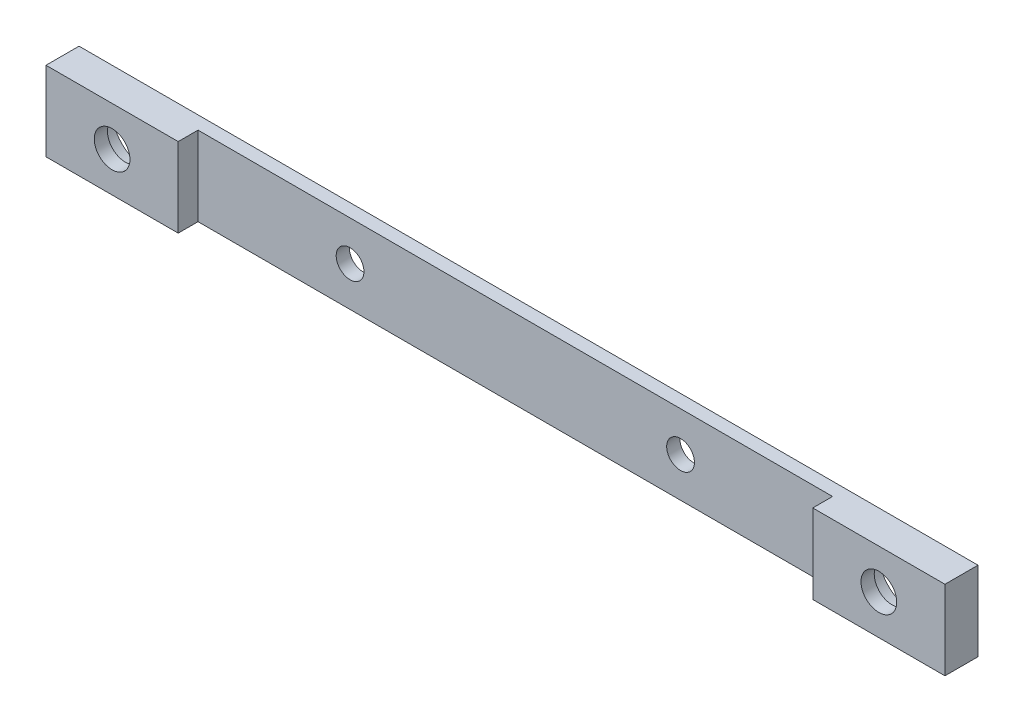
ISO-10303-21;
HEADER;
FILE_DESCRIPTION(('STEP AP214'),'2;1');
FILE_NAME('part.step','',(''),(''),'','','');
FILE_SCHEMA(('AUTOMOTIVE_DESIGN { 1 0 10303 214 1 1 1 1 }'));
ENDSEC;
DATA;
#1=APPLICATION_CONTEXT('core data for automotive mechanical design processes');
#2=APPLICATION_PROTOCOL_DEFINITION('international standard','automotive_design',2000,#1);
#3=PRODUCT_CONTEXT('',#1,'mechanical');
#4=PRODUCT('Part','Part','',(#3));
#5=PRODUCT_RELATED_PRODUCT_CATEGORY('part','',(#4));
#6=PRODUCT_DEFINITION_FORMATION('','',#4);
#7=PRODUCT_DEFINITION_CONTEXT('part definition',#1,'design');
#8=PRODUCT_DEFINITION('design','',#6,#7);
#9=PRODUCT_DEFINITION_SHAPE('','',#8);
#10=(LENGTH_UNIT() NAMED_UNIT(*) SI_UNIT(.MILLI.,.METRE.));
#11=(NAMED_UNIT(*) PLANE_ANGLE_UNIT() SI_UNIT($,.RADIAN.));
#12=(NAMED_UNIT(*) SI_UNIT($,.STERADIAN.) SOLID_ANGLE_UNIT());
#13=UNCERTAINTY_MEASURE_WITH_UNIT(LENGTH_MEASURE(1.E-05),#10,'distance_accuracy_value','');
#14=(GEOMETRIC_REPRESENTATION_CONTEXT(3) GLOBAL_UNCERTAINTY_ASSIGNED_CONTEXT((#13)) GLOBAL_UNIT_ASSIGNED_CONTEXT((#10,
#11,#12)) REPRESENTATION_CONTEXT('',''));
#15=CARTESIAN_POINT('',(0.,0.,0.));
#16=DIRECTION('',(0.,0.,1.));
#17=DIRECTION('',(1.,0.,0.));
#18=AXIS2_PLACEMENT_3D('',#15,#16,#17);
#19=CARTESIAN_POINT('',(58.,0.,5.));
#20=DIRECTION('',(0.,0.,-1.));
#21=DIRECTION('',(-1.,0.,0.));
#22=AXIS2_PLACEMENT_3D('',#19,#20,#21);
#23=CYLINDRICAL_SURFACE('',#22,2.7);
#24=CARTESIAN_POINT('',(58.,0.,5.));
#25=DIRECTION('',(0.,0.,1.));
#26=DIRECTION('',(1.,0.,0.));
#27=AXIS2_PLACEMENT_3D('',#24,#25,#26);
#28=CIRCLE('',#27,2.7);
#29=CARTESIAN_POINT('',(60.7,0.,5.));
#30=VERTEX_POINT('',#29);
#31=EDGE_CURVE('E169',#30,#30,#28,.F.);
#32=ORIENTED_EDGE('',*,*,#31,.F.);
#33=EDGE_LOOP('',(#32));
#34=FACE_BOUND('',#33,.T.);
#35=CARTESIAN_POINT('',(58.,0.,3.));
#36=DIRECTION('',(0.,0.,-1.));
#37=DIRECTION('',(-1.,0.,0.));
#38=AXIS2_PLACEMENT_3D('',#35,#36,#37);
#39=CIRCLE('',#38,2.7);
#40=CARTESIAN_POINT('',(55.3,0.,3.));
#41=VERTEX_POINT('',#40);
#42=EDGE_CURVE('E40',#41,#41,#39,.F.);
#43=ORIENTED_EDGE('',*,*,#42,.F.);
#44=EDGE_LOOP('',(#43));
#45=FACE_BOUND('',#44,.T.);
#46=ADVANCED_FACE('F36',(#34,#45),#23,.F.);
#47=CARTESIAN_POINT('',(0.,0.,0.));
#48=DIRECTION('',(0.,0.,1.));
#49=DIRECTION('',(1.,0.,0.));
#50=AXIS2_PLACEMENT_3D('',#47,#48,#49);
#51=PLANE('',#50);
#52=CARTESIAN_POINT('',(58.,0.,0.));
#53=DIRECTION('',(0.,0.,-1.));
#54=DIRECTION('',(-1.,0.,0.));
#55=AXIS2_PLACEMENT_3D('',#52,#53,#54);
#56=CIRCLE('',#55,5.);
#57=CARTESIAN_POINT('',(53.,0.,0.));
#58=VERTEX_POINT('',#57);
#59=EDGE_CURVE('E448',#58,#58,#56,.T.);
#60=ORIENTED_EDGE('',*,*,#59,.F.);
#61=EDGE_LOOP('',(#60));
#62=FACE_BOUND('',#61,.T.);
#63=DIRECTION('',(1.,0.,0.));
#64=VECTOR('',#63,1.);
#65=CARTESIAN_POINT('',(0.,6.,0.));
#66=LINE('',#65,#64);
#67=CARTESIAN_POINT('',(-68.,6.,0.));
#68=VERTEX_POINT('',#67);
#69=CARTESIAN_POINT('',(68.,6.,0.));
#70=VERTEX_POINT('',#69);
#71=EDGE_CURVE('E183',#68,#70,#66,.T.);
#72=ORIENTED_EDGE('',*,*,#71,.T.);
#73=DIRECTION('',(0.,1.,0.));
#74=VECTOR('',#73,1.);
#75=CARTESIAN_POINT('',(68.,0.,0.));
#76=LINE('',#75,#74);
#77=CARTESIAN_POINT('',(68.,-6.,0.));
#78=VERTEX_POINT('',#77);
#79=EDGE_CURVE('E195',#78,#70,#76,.T.);
#80=ORIENTED_EDGE('',*,*,#79,.F.);
#81=DIRECTION('',(1.,0.,0.));
#82=VECTOR('',#81,1.);
#83=CARTESIAN_POINT('',(0.,-6.,0.));
#84=LINE('',#83,#82);
#85=CARTESIAN_POINT('',(-68.,-6.,0.));
#86=VERTEX_POINT('',#85);
#87=EDGE_CURVE('E191',#86,#78,#84,.T.);
#88=ORIENTED_EDGE('',*,*,#87,.F.);
#89=DIRECTION('',(0.,1.,0.));
#90=VECTOR('',#89,1.);
#91=CARTESIAN_POINT('',(-68.,0.,0.));
#92=LINE('',#91,#90);
#93=EDGE_CURVE('E187',#86,#68,#92,.T.);
#94=ORIENTED_EDGE('',*,*,#93,.T.);
#95=EDGE_LOOP('',(#72,#80,#88,#94));
#96=FACE_BOUND('',#95,.T.);
#97=CARTESIAN_POINT('',(-25.,0.,0.));
#98=DIRECTION('',(0.,0.,1.));
#99=DIRECTION('',(1.,0.,0.));
#100=AXIS2_PLACEMENT_3D('',#97,#98,#99);
#101=CIRCLE('',#100,2.1);
#102=CARTESIAN_POINT('',(-22.9,0.,0.));
#103=VERTEX_POINT('',#102);
#104=EDGE_CURVE('E179',#103,#103,#101,.T.);
#105=ORIENTED_EDGE('',*,*,#104,.T.);
#106=EDGE_LOOP('',(#105));
#107=FACE_BOUND('',#106,.T.);
#108=CARTESIAN_POINT('',(25.,0.,0.));
#109=DIRECTION('',(0.,0.,1.));
#110=DIRECTION('',(1.,0.,0.));
#111=AXIS2_PLACEMENT_3D('',#108,#109,#110);
#112=CIRCLE('',#111,2.1);
#113=CARTESIAN_POINT('',(27.1,0.,0.));
#114=VERTEX_POINT('',#113);
#115=EDGE_CURVE('E153',#114,#114,#112,.F.);
#116=ORIENTED_EDGE('',*,*,#115,.F.);
#117=EDGE_LOOP('',(#116));
#118=FACE_BOUND('',#117,.T.);
#119=CARTESIAN_POINT('',(-58.,0.,0.));
#120=DIRECTION('',(0.,0.,1.));
#121=DIRECTION('',(1.,0.,0.));
#122=AXIS2_PLACEMENT_3D('',#119,#120,#121);
#123=CIRCLE('',#122,5.);
#124=CARTESIAN_POINT('',(-53.,0.,0.));
#125=VERTEX_POINT('',#124);
#126=EDGE_CURVE('E217',#125,#125,#123,.T.);
#127=ORIENTED_EDGE('',*,*,#126,.T.);
#128=EDGE_LOOP('',(#127));
#129=FACE_BOUND('',#128,.T.);
#130=ADVANCED_FACE('F249',(#62,#96,#107,#118,#129),#51,.F.);
#131=CARTESIAN_POINT('',(0.,0.,5.));
#132=DIRECTION('',(0.,0.,1.));
#133=DIRECTION('',(1.,0.,0.));
#134=AXIS2_PLACEMENT_3D('',#131,#132,#133);
#135=PLANE('',#134);
#136=DIRECTION('',(0.,-1.,0.));
#137=VECTOR('',#136,1.);
#138=CARTESIAN_POINT('',(48.,102.046863561493,5.));
#139=LINE('',#138,#137);
#140=CARTESIAN_POINT('',(48.,6.00000000000001,5.));
#141=VERTEX_POINT('',#140);
#142=CARTESIAN_POINT('',(48.,-6.,5.));
#143=VERTEX_POINT('',#142);
#144=EDGE_CURVE('E115',#141,#143,#139,.T.);
#145=ORIENTED_EDGE('',*,*,#144,.T.);
#146=DIRECTION('',(1.,0.,0.));
#147=VECTOR('',#146,1.);
#148=CARTESIAN_POINT('',(0.,-6.,5.));
#149=LINE('',#148,#147);
#150=CARTESIAN_POINT('',(68.,-6.,5.));
#151=VERTEX_POINT('',#150);
#152=EDGE_CURVE('E161',#143,#151,#149,.T.);
#153=ORIENTED_EDGE('',*,*,#152,.T.);
#154=DIRECTION('',(0.,1.,0.));
#155=VECTOR('',#154,1.);
#156=CARTESIAN_POINT('',(68.,0.,5.));
#157=LINE('',#156,#155);
#158=CARTESIAN_POINT('',(68.,6.,5.));
#159=VERTEX_POINT('',#158);
#160=EDGE_CURVE('E166',#151,#159,#157,.T.);
#161=ORIENTED_EDGE('',*,*,#160,.T.);
#162=DIRECTION('',(1.,0.,0.));
#163=VECTOR('',#162,1.);
#164=CARTESIAN_POINT('',(0.,6.,5.));
#165=LINE('',#164,#163);
#166=EDGE_CURVE('E63',#141,#159,#165,.T.);
#167=ORIENTED_EDGE('',*,*,#166,.F.);
#168=EDGE_LOOP('',(#145,#153,#161,#167));
#169=FACE_BOUND('',#168,.T.);
#170=ORIENTED_EDGE('',*,*,#31,.T.);
#171=EDGE_LOOP('',(#170));
#172=FACE_BOUND('',#171,.T.);
#173=ADVANCED_FACE('F253',(#169,#172),#135,.T.);
#174=CARTESIAN_POINT('',(0.,6.,5.));
#175=DIRECTION('',(0.,1.,0.));
#176=DIRECTION('',(0.,0.,1.));
#177=AXIS2_PLACEMENT_3D('',#174,#175,#176);
#178=PLANE('',#177);
#179=DIRECTION('',(0.,0.,1.));
#180=VECTOR('',#179,1.);
#181=CARTESIAN_POINT('',(48.,6.00000000000001,5.));
#182=LINE('',#181,#180);
#183=CARTESIAN_POINT('',(48.,6.00000000000003,2.));
#184=VERTEX_POINT('',#183);
#185=EDGE_CURVE('E109',#184,#141,#182,.T.);
#186=ORIENTED_EDGE('',*,*,#185,.T.);
#187=ORIENTED_EDGE('',*,*,#166,.T.);
#188=DIRECTION('',(0.,0.,-1.));
#189=VECTOR('',#188,1.);
#190=CARTESIAN_POINT('',(68.,6.,5.));
#191=LINE('',#190,#189);
#192=EDGE_CURVE('E82',#159,#70,#191,.T.);
#193=ORIENTED_EDGE('',*,*,#192,.T.);
#194=ORIENTED_EDGE('',*,*,#71,.F.);
#195=DIRECTION('',(0.,0.,-1.));
#196=VECTOR('',#195,1.);
#197=CARTESIAN_POINT('',(-68.,6.,5.));
#198=LINE('',#197,#196);
#199=CARTESIAN_POINT('',(-68.,6.,5.));
#200=VERTEX_POINT('',#199);
#201=EDGE_CURVE('E11',#200,#68,#198,.T.);
#202=ORIENTED_EDGE('',*,*,#201,.F.);
#203=CARTESIAN_POINT('',(-48.,6.,5.));
#204=VERTEX_POINT('',#203);
#205=EDGE_CURVE('E154',#200,#204,#165,.T.);
#206=ORIENTED_EDGE('',*,*,#205,.T.);
#207=DIRECTION('',(0.,0.,-1.));
#208=VECTOR('',#207,1.);
#209=CARTESIAN_POINT('',(-48.,6.00000000000001,5.));
#210=LINE('',#209,#208);
#211=CARTESIAN_POINT('',(-48.,6.00000000000001,2.));
#212=VERTEX_POINT('',#211);
#213=EDGE_CURVE('E54',#204,#212,#210,.T.);
#214=ORIENTED_EDGE('',*,*,#213,.T.);
#215=DIRECTION('',(1.,0.,0.));
#216=VECTOR('',#215,1.);
#217=CARTESIAN_POINT('',(-48.,6.00000000000001,2.));
#218=LINE('',#217,#216);
#219=EDGE_CURVE('E122',#212,#184,#218,.T.);
#220=ORIENTED_EDGE('',*,*,#219,.T.);
#221=EDGE_LOOP('',(#186,#187,#193,#194,#202,#206,#214,#220));
#222=FACE_BOUND('',#221,.T.);
#223=ADVANCED_FACE('F128',(#222),#178,.T.);
#224=CARTESIAN_POINT('',(-68.,0.,5.));
#225=DIRECTION('',(-1.,0.,0.));
#226=DIRECTION('',(0.,0.,1.));
#227=AXIS2_PLACEMENT_3D('',#224,#225,#226);
#228=PLANE('',#227);
#229=ORIENTED_EDGE('',*,*,#93,.F.);
#230=DIRECTION('',(0.,0.,-1.));
#231=VECTOR('',#230,1.);
#232=CARTESIAN_POINT('',(-68.,-6.,5.));
#233=LINE('',#232,#231);
#234=CARTESIAN_POINT('',(-68.,-6.,5.));
#235=VERTEX_POINT('',#234);
#236=EDGE_CURVE('E46',#235,#86,#233,.T.);
#237=ORIENTED_EDGE('',*,*,#236,.F.);
#238=DIRECTION('',(0.,1.,0.));
#239=VECTOR('',#238,1.);
#240=CARTESIAN_POINT('',(-68.,0.,5.));
#241=LINE('',#240,#239);
#242=EDGE_CURVE('E157',#235,#200,#241,.T.);
#243=ORIENTED_EDGE('',*,*,#242,.T.);
#244=ORIENTED_EDGE('',*,*,#201,.T.);
#245=EDGE_LOOP('',(#229,#237,#243,#244));
#246=FACE_BOUND('',#245,.T.);
#247=ADVANCED_FACE('F275',(#246),#228,.T.);
#248=CARTESIAN_POINT('',(0.,-6.,5.));
#249=DIRECTION('',(0.,1.,0.));
#250=DIRECTION('',(0.,0.,1.));
#251=AXIS2_PLACEMENT_3D('',#248,#249,#250);
#252=PLANE('',#251);
#253=ORIENTED_EDGE('',*,*,#152,.F.);
#254=DIRECTION('',(0.,0.,1.));
#255=VECTOR('',#254,1.);
#256=CARTESIAN_POINT('',(48.,-6.,5.));
#257=LINE('',#256,#255);
#258=CARTESIAN_POINT('',(48.,-6.,2.));
#259=VERTEX_POINT('',#258);
#260=EDGE_CURVE('E130',#259,#143,#257,.T.);
#261=ORIENTED_EDGE('',*,*,#260,.F.);
#262=DIRECTION('',(1.,0.,0.));
#263=VECTOR('',#262,1.);
#264=CARTESIAN_POINT('',(-48.,-6.,2.));
#265=LINE('',#264,#263);
#266=CARTESIAN_POINT('',(-48.,-6.,2.));
#267=VERTEX_POINT('',#266);
#268=EDGE_CURVE('E124',#267,#259,#265,.T.);
#269=ORIENTED_EDGE('',*,*,#268,.F.);
#270=DIRECTION('',(0.,0.,-1.));
#271=VECTOR('',#270,1.);
#272=CARTESIAN_POINT('',(-48.,-6.,5.));
#273=LINE('',#272,#271);
#274=CARTESIAN_POINT('',(-48.,-6.,5.));
#275=VERTEX_POINT('',#274);
#276=EDGE_CURVE('E138',#275,#267,#273,.T.);
#277=ORIENTED_EDGE('',*,*,#276,.F.);
#278=EDGE_CURVE('E162',#235,#275,#149,.T.);
#279=ORIENTED_EDGE('',*,*,#278,.F.);
#280=ORIENTED_EDGE('',*,*,#236,.T.);
#281=ORIENTED_EDGE('',*,*,#87,.T.);
#282=DIRECTION('',(0.,0.,-1.));
#283=VECTOR('',#282,1.);
#284=CARTESIAN_POINT('',(68.,-6.,5.));
#285=LINE('',#284,#283);
#286=EDGE_CURVE('E200',#151,#78,#285,.T.);
#287=ORIENTED_EDGE('',*,*,#286,.F.);
#288=EDGE_LOOP('',(#253,#261,#269,#277,#279,#280,#281,#287));
#289=FACE_BOUND('',#288,.T.);
#290=ADVANCED_FACE('F282',(#289),#252,.F.);
#291=CARTESIAN_POINT('',(68.,0.,5.));
#292=DIRECTION('',(-1.,0.,0.));
#293=DIRECTION('',(0.,0.,1.));
#294=AXIS2_PLACEMENT_3D('',#291,#292,#293);
#295=PLANE('',#294);
#296=ORIENTED_EDGE('',*,*,#79,.T.);
#297=ORIENTED_EDGE('',*,*,#192,.F.);
#298=ORIENTED_EDGE('',*,*,#160,.F.);
#299=ORIENTED_EDGE('',*,*,#286,.T.);
#300=EDGE_LOOP('',(#296,#297,#298,#299));
#301=FACE_BOUND('',#300,.T.);
#302=ADVANCED_FACE('F291',(#301),#295,.F.);
#303=CARTESIAN_POINT('',(-25.,0.,5.));
#304=DIRECTION('',(0.,0.,-1.));
#305=DIRECTION('',(-1.,0.,0.));
#306=AXIS2_PLACEMENT_3D('',#303,#304,#305);
#307=CYLINDRICAL_SURFACE('',#306,2.1);
#308=CARTESIAN_POINT('',(-25.,0.,2.));
#309=DIRECTION('',(0.,0.,-1.));
#310=DIRECTION('',(-1.,0.,0.));
#311=AXIS2_PLACEMENT_3D('',#308,#309,#310);
#312=CIRCLE('',#311,2.1);
#313=CARTESIAN_POINT('',(-27.1,0.,2.));
#314=VERTEX_POINT('',#313);
#315=EDGE_CURVE('E149',#314,#314,#312,.T.);
#316=ORIENTED_EDGE('',*,*,#315,.F.);
#317=EDGE_LOOP('',(#316));
#318=FACE_BOUND('',#317,.T.);
#319=ORIENTED_EDGE('',*,*,#104,.F.);
#320=EDGE_LOOP('',(#319));
#321=FACE_BOUND('',#320,.T.);
#322=ADVANCED_FACE('F300',(#318,#321),#307,.F.);
#323=CARTESIAN_POINT('',(25.,0.,5.));
#324=DIRECTION('',(0.,0.,-1.));
#325=DIRECTION('',(-1.,0.,0.));
#326=AXIS2_PLACEMENT_3D('',#323,#324,#325);
#327=CYLINDRICAL_SURFACE('',#326,2.1);
#328=CARTESIAN_POINT('',(25.,0.,2.));
#329=DIRECTION('',(0.,0.,-1.));
#330=DIRECTION('',(-1.,0.,0.));
#331=AXIS2_PLACEMENT_3D('',#328,#329,#330);
#332=CIRCLE('',#331,2.1);
#333=CARTESIAN_POINT('',(22.9,0.,2.));
#334=VERTEX_POINT('',#333);
#335=EDGE_CURVE('E148',#334,#334,#332,.F.);
#336=ORIENTED_EDGE('',*,*,#335,.T.);
#337=EDGE_LOOP('',(#336));
#338=FACE_BOUND('',#337,.T.);
#339=ORIENTED_EDGE('',*,*,#115,.T.);
#340=EDGE_LOOP('',(#339));
#341=FACE_BOUND('',#340,.T.);
#342=ADVANCED_FACE('F38',(#338,#341),#327,.F.);
#343=CARTESIAN_POINT('',(-58.,0.,5.));
#344=DIRECTION('',(0.,0.,-1.));
#345=DIRECTION('',(-1.,0.,0.));
#346=AXIS2_PLACEMENT_3D('',#343,#344,#345);
#347=CYLINDRICAL_SURFACE('',#346,2.7);
#348=CARTESIAN_POINT('',(-58.,0.,3.));
#349=DIRECTION('',(0.,0.,1.));
#350=DIRECTION('',(1.,0.,0.));
#351=AXIS2_PLACEMENT_3D('',#348,#349,#350);
#352=CIRCLE('',#351,2.7);
#353=CARTESIAN_POINT('',(-55.3,0.,3.));
#354=VERTEX_POINT('',#353);
#355=EDGE_CURVE('E206',#354,#354,#352,.T.);
#356=ORIENTED_EDGE('',*,*,#355,.F.);
#357=EDGE_LOOP('',(#356));
#358=FACE_BOUND('',#357,.T.);
#359=CARTESIAN_POINT('',(-58.,0.,5.));
#360=DIRECTION('',(0.,0.,1.));
#361=DIRECTION('',(1.,0.,0.));
#362=AXIS2_PLACEMENT_3D('',#359,#360,#361);
#363=CIRCLE('',#362,2.7);
#364=CARTESIAN_POINT('',(-55.3,0.,5.));
#365=VERTEX_POINT('',#364);
#366=EDGE_CURVE('E173',#365,#365,#363,.T.);
#367=ORIENTED_EDGE('',*,*,#366,.T.);
#368=EDGE_LOOP('',(#367));
#369=FACE_BOUND('',#368,.T.);
#370=ADVANCED_FACE('F313',(#358,#369),#347,.F.);
#371=DIRECTION('',(0.,-1.,0.));
#372=VECTOR('',#371,1.);
#373=CARTESIAN_POINT('',(-48.,102.046863561493,5.));
#374=LINE('',#373,#372);
#375=EDGE_CURVE('E141',#204,#275,#374,.T.);
#376=ORIENTED_EDGE('',*,*,#375,.F.);
#377=ORIENTED_EDGE('',*,*,#205,.F.);
#378=ORIENTED_EDGE('',*,*,#242,.F.);
#379=ORIENTED_EDGE('',*,*,#278,.T.);
#380=EDGE_LOOP('',(#376,#377,#378,#379));
#381=FACE_BOUND('',#380,.T.);
#382=ORIENTED_EDGE('',*,*,#366,.F.);
#383=EDGE_LOOP('',(#382));
#384=FACE_BOUND('',#383,.T.);
#385=ADVANCED_FACE('F238',(#381,#384),#135,.T.);
#386=CARTESIAN_POINT('',(-48.,102.046863561493,2.));
#387=DIRECTION('',(0.,0.,-1.));
#388=DIRECTION('',(-1.,0.,0.));
#389=AXIS2_PLACEMENT_3D('',#386,#387,#388);
#390=PLANE('',#389);
#391=ORIENTED_EDGE('',*,*,#315,.T.);
#392=EDGE_LOOP('',(#391));
#393=FACE_BOUND('',#392,.T.);
#394=DIRECTION('',(0.,-1.,0.));
#395=VECTOR('',#394,1.);
#396=CARTESIAN_POINT('',(-48.,102.046863561493,2.));
#397=LINE('',#396,#395);
#398=EDGE_CURVE('E140',#212,#267,#397,.T.);
#399=ORIENTED_EDGE('',*,*,#398,.T.);
#400=ORIENTED_EDGE('',*,*,#268,.T.);
#401=DIRECTION('',(0.,-1.,0.));
#402=VECTOR('',#401,1.);
#403=CARTESIAN_POINT('',(48.,102.046863561493,2.));
#404=LINE('',#403,#402);
#405=EDGE_CURVE('E112',#184,#259,#404,.T.);
#406=ORIENTED_EDGE('',*,*,#405,.F.);
#407=ORIENTED_EDGE('',*,*,#219,.F.);
#408=EDGE_LOOP('',(#399,#400,#406,#407));
#409=FACE_BOUND('',#408,.T.);
#410=ORIENTED_EDGE('',*,*,#335,.F.);
#411=EDGE_LOOP('',(#410));
#412=FACE_BOUND('',#411,.T.);
#413=ADVANCED_FACE('F120',(#393,#409,#412),#390,.F.);
#414=CARTESIAN_POINT('',(48.,102.046863561493,5.));
#415=DIRECTION('',(1.,0.,0.));
#416=DIRECTION('',(0.,0.,-1.));
#417=AXIS2_PLACEMENT_3D('',#414,#415,#416);
#418=PLANE('',#417);
#419=ORIENTED_EDGE('',*,*,#405,.T.);
#420=ORIENTED_EDGE('',*,*,#260,.T.);
#421=ORIENTED_EDGE('',*,*,#144,.F.);
#422=ORIENTED_EDGE('',*,*,#185,.F.);
#423=EDGE_LOOP('',(#419,#420,#421,#422));
#424=FACE_BOUND('',#423,.T.);
#425=ADVANCED_FACE('F111',(#424),#418,.F.);
#426=CARTESIAN_POINT('',(-48.,102.046863561493,5.));
#427=DIRECTION('',(-1.,0.,0.));
#428=DIRECTION('',(0.,0.,1.));
#429=AXIS2_PLACEMENT_3D('',#426,#427,#428);
#430=PLANE('',#429);
#431=ORIENTED_EDGE('',*,*,#375,.T.);
#432=ORIENTED_EDGE('',*,*,#276,.T.);
#433=ORIENTED_EDGE('',*,*,#398,.F.);
#434=ORIENTED_EDGE('',*,*,#213,.F.);
#435=EDGE_LOOP('',(#431,#432,#433,#434));
#436=FACE_BOUND('',#435,.T.);
#437=ADVANCED_FACE('F368',(#436),#430,.F.);
#438=CARTESIAN_POINT('',(-58.,0.,3.));
#439=DIRECTION('',(0.,0.,-1.));
#440=DIRECTION('',(-1.,0.,0.));
#441=AXIS2_PLACEMENT_3D('',#438,#439,#440);
#442=CYLINDRICAL_SURFACE('',#441,5.);
#443=CARTESIAN_POINT('',(-58.,0.,3.));
#444=DIRECTION('',(0.,0.,1.));
#445=DIRECTION('',(1.,0.,0.));
#446=AXIS2_PLACEMENT_3D('',#443,#444,#445);
#447=CIRCLE('',#446,5.);
#448=CARTESIAN_POINT('',(-53.,0.,3.));
#449=VERTEX_POINT('',#448);
#450=EDGE_CURVE('E209',#449,#449,#447,.T.);
#451=ORIENTED_EDGE('',*,*,#450,.T.);
#452=EDGE_LOOP('',(#451));
#453=FACE_BOUND('',#452,.T.);
#454=ORIENTED_EDGE('',*,*,#126,.F.);
#455=EDGE_LOOP('',(#454));
#456=FACE_BOUND('',#455,.T.);
#457=ADVANCED_FACE('F376',(#453,#456),#442,.F.);
#458=CARTESIAN_POINT('',(-58.,0.,3.));
#459=DIRECTION('',(0.,0.,1.));
#460=DIRECTION('',(1.,0.,0.));
#461=AXIS2_PLACEMENT_3D('',#458,#459,#460);
#462=PLANE('',#461);
#463=ORIENTED_EDGE('',*,*,#355,.T.);
#464=EDGE_LOOP('',(#463));
#465=FACE_BOUND('',#464,.T.);
#466=ORIENTED_EDGE('',*,*,#450,.F.);
#467=EDGE_LOOP('',(#466));
#468=FACE_BOUND('',#467,.T.);
#469=ADVANCED_FACE('F398',(#465,#468),#462,.F.);
#470=CARTESIAN_POINT('',(58.,0.,3.));
#471=DIRECTION('',(0.,0.,-1.));
#472=DIRECTION('',(-1.,0.,0.));
#473=AXIS2_PLACEMENT_3D('',#470,#471,#472);
#474=PLANE('',#473);
#475=CARTESIAN_POINT('',(58.,0.,3.));
#476=DIRECTION('',(0.,0.,-1.));
#477=DIRECTION('',(-1.,0.,0.));
#478=AXIS2_PLACEMENT_3D('',#475,#476,#477);
#479=CIRCLE('',#478,5.);
#480=CARTESIAN_POINT('',(53.,0.,3.));
#481=VERTEX_POINT('',#480);
#482=EDGE_CURVE('E227',#481,#481,#479,.T.);
#483=ORIENTED_EDGE('',*,*,#482,.T.);
#484=EDGE_LOOP('',(#483));
#485=FACE_BOUND('',#484,.T.);
#486=ORIENTED_EDGE('',*,*,#42,.T.);
#487=EDGE_LOOP('',(#486));
#488=FACE_BOUND('',#487,.T.);
#489=ADVANCED_FACE('F406',(#485,#488),#474,.T.);
#490=CARTESIAN_POINT('',(58.,0.,3.));
#491=DIRECTION('',(0.,0.,-1.));
#492=DIRECTION('',(-1.,0.,0.));
#493=AXIS2_PLACEMENT_3D('',#490,#491,#492);
#494=CYLINDRICAL_SURFACE('',#493,5.);
#495=ORIENTED_EDGE('',*,*,#482,.F.);
#496=EDGE_LOOP('',(#495));
#497=FACE_BOUND('',#496,.T.);
#498=ORIENTED_EDGE('',*,*,#59,.T.);
#499=EDGE_LOOP('',(#498));
#500=FACE_BOUND('',#499,.T.);
#501=ADVANCED_FACE('F414',(#497,#500),#494,.F.);
#502=CLOSED_SHELL('',(#46,#130,#173,#223,#247,#290,#302,#322,#342,#370,#385,#413,#425,#437,#457,
#469,#489,#501));
#503=MANIFOLD_SOLID_BREP('B2',#502);
#504=ADVANCED_BREP_SHAPE_REPRESENTATION('',(#18,#503),#14);
#505=SHAPE_DEFINITION_REPRESENTATION(#9,#504);
ENDSEC;
END-ISO-10303-21;
